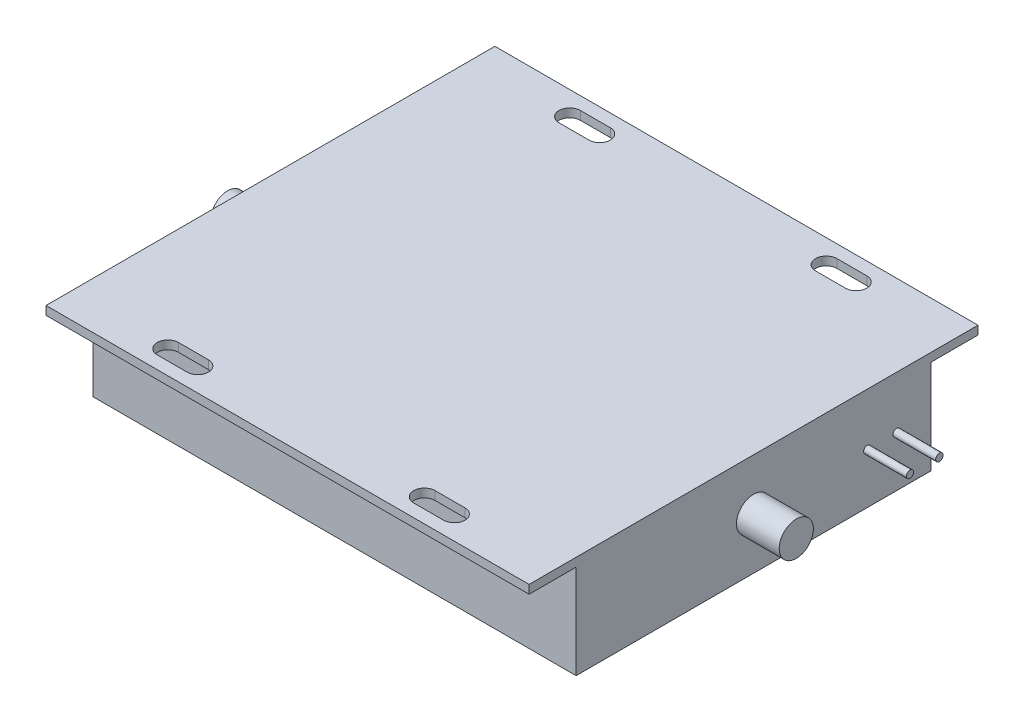
ISO-10303-21;
HEADER;
FILE_DESCRIPTION(('STEP AP214'),'2;1');
FILE_NAME('part.step','',(''),(''),'','','');
FILE_SCHEMA(('AUTOMOTIVE_DESIGN { 1 0 10303 214 1 1 1 1 }'));
ENDSEC;
DATA;
#1=APPLICATION_CONTEXT('core data for automotive mechanical design processes');
#2=APPLICATION_PROTOCOL_DEFINITION('international standard','automotive_design',2000,#1);
#3=PRODUCT_CONTEXT('',#1,'mechanical');
#4=PRODUCT('Part','Part','',(#3));
#5=PRODUCT_RELATED_PRODUCT_CATEGORY('part','',(#4));
#6=PRODUCT_DEFINITION_FORMATION('','',#4);
#7=PRODUCT_DEFINITION_CONTEXT('part definition',#1,'design');
#8=PRODUCT_DEFINITION('design','',#6,#7);
#9=PRODUCT_DEFINITION_SHAPE('','',#8);
#10=(LENGTH_UNIT() NAMED_UNIT(*) SI_UNIT(.MILLI.,.METRE.));
#11=(NAMED_UNIT(*) PLANE_ANGLE_UNIT() SI_UNIT($,.RADIAN.));
#12=(NAMED_UNIT(*) SI_UNIT($,.STERADIAN.) SOLID_ANGLE_UNIT());
#13=UNCERTAINTY_MEASURE_WITH_UNIT(LENGTH_MEASURE(1.E-05),#10,'distance_accuracy_value','');
#14=(GEOMETRIC_REPRESENTATION_CONTEXT(3) GLOBAL_UNCERTAINTY_ASSIGNED_CONTEXT((#13)) GLOBAL_UNIT_ASSIGNED_CONTEXT((#10,
#11,#12)) REPRESENTATION_CONTEXT('',''));
#15=CARTESIAN_POINT('',(0.,0.,0.));
#16=DIRECTION('',(0.,0.,1.));
#17=DIRECTION('',(1.,0.,0.));
#18=AXIS2_PLACEMENT_3D('',#15,#16,#17);
#19=CARTESIAN_POINT('',(0.,31.,0.));
#20=DIRECTION('',(0.,1.,0.));
#21=DIRECTION('',(0.,0.,1.));
#22=AXIS2_PLACEMENT_3D('',#19,#20,#21);
#23=PLANE('',#22);
#24=CARTESIAN_POINT('',(-26.5,31.,47.));
#25=DIRECTION('',(0.,1.,0.));
#26=DIRECTION('',(0.,0.,-1.));
#27=AXIS2_PLACEMENT_3D('',#24,#25,#26);
#28=CIRCLE('',#27,2.50000000000001);
#29=CARTESIAN_POINT('',(-26.5,31.,49.5));
#30=VERTEX_POINT('',#29);
#31=CARTESIAN_POINT('',(-26.5,31.,44.5));
#32=VERTEX_POINT('',#31);
#33=EDGE_CURVE('E218',#30,#32,#28,.T.);
#34=ORIENTED_EDGE('',*,*,#33,.F.);
#35=DIRECTION('',(-1.,0.,0.));
#36=VECTOR('',#35,1.);
#37=CARTESIAN_POINT('',(-26.5,31.,49.5));
#38=LINE('',#37,#36);
#39=CARTESIAN_POINT('',(-33.5,31.,49.5));
#40=VERTEX_POINT('',#39);
#41=EDGE_CURVE('E228',#30,#40,#38,.T.);
#42=ORIENTED_EDGE('',*,*,#41,.T.);
#43=CARTESIAN_POINT('',(-33.5,31.,47.));
#44=DIRECTION('',(0.,1.,0.));
#45=DIRECTION('',(0.,0.,-1.));
#46=AXIS2_PLACEMENT_3D('',#43,#44,#45);
#47=CIRCLE('',#46,2.5);
#48=CARTESIAN_POINT('',(-33.5,31.,44.5));
#49=VERTEX_POINT('',#48);
#50=EDGE_CURVE('E225',#49,#40,#47,.T.);
#51=ORIENTED_EDGE('',*,*,#50,.F.);
#52=DIRECTION('',(-1.,0.,0.));
#53=VECTOR('',#52,1.);
#54=CARTESIAN_POINT('',(-26.5,31.,44.5));
#55=LINE('',#54,#53);
#56=EDGE_CURVE('E222',#32,#49,#55,.T.);
#57=ORIENTED_EDGE('',*,*,#56,.F.);
#58=EDGE_LOOP('',(#34,#42,#51,#57));
#59=FACE_BOUND('',#58,.T.);
#60=CARTESIAN_POINT('',(26.5,31.,-47.));
#61=DIRECTION('',(0.,1.,0.));
#62=DIRECTION('',(0.,0.,1.));
#63=AXIS2_PLACEMENT_3D('',#60,#61,#62);
#64=CIRCLE('',#63,2.50000000000001);
#65=CARTESIAN_POINT('',(26.5,31.,-49.5));
#66=VERTEX_POINT('',#65);
#67=CARTESIAN_POINT('',(26.5,31.,-44.5));
#68=VERTEX_POINT('',#67);
#69=EDGE_CURVE('E255',#66,#68,#64,.T.);
#70=ORIENTED_EDGE('',*,*,#69,.F.);
#71=DIRECTION('',(1.,0.,0.));
#72=VECTOR('',#71,1.);
#73=CARTESIAN_POINT('',(26.5,31.,-49.5));
#74=LINE('',#73,#72);
#75=CARTESIAN_POINT('',(33.5,31.,-49.5));
#76=VERTEX_POINT('',#75);
#77=EDGE_CURVE('E269',#66,#76,#74,.T.);
#78=ORIENTED_EDGE('',*,*,#77,.T.);
#79=CARTESIAN_POINT('',(33.5,31.,-47.));
#80=DIRECTION('',(0.,1.,0.));
#81=DIRECTION('',(0.,0.,1.));
#82=AXIS2_PLACEMENT_3D('',#79,#80,#81);
#83=CIRCLE('',#82,2.5);
#84=CARTESIAN_POINT('',(33.5,31.,-44.5));
#85=VERTEX_POINT('',#84);
#86=EDGE_CURVE('E266',#85,#76,#83,.T.);
#87=ORIENTED_EDGE('',*,*,#86,.F.);
#88=DIRECTION('',(1.,0.,0.));
#89=VECTOR('',#88,1.);
#90=CARTESIAN_POINT('',(26.5,31.,-44.5));
#91=LINE('',#90,#89);
#92=EDGE_CURVE('E263',#68,#85,#91,.T.);
#93=ORIENTED_EDGE('',*,*,#92,.F.);
#94=EDGE_LOOP('',(#70,#78,#87,#93));
#95=FACE_BOUND('',#94,.T.);
#96=DIRECTION('',(0.,0.,1.));
#97=VECTOR('',#96,1.);
#98=CARTESIAN_POINT('',(-56.5,31.,-41.5));
#99=LINE('',#98,#97);
#100=CARTESIAN_POINT('',(-56.5,31.,-52.5));
#101=VERTEX_POINT('',#100);
#102=CARTESIAN_POINT('',(-56.5,31.,52.5));
#103=VERTEX_POINT('',#102);
#104=EDGE_CURVE('E322',#101,#103,#99,.T.);
#105=ORIENTED_EDGE('',*,*,#104,.T.);
#106=DIRECTION('',(1.,0.,0.));
#107=VECTOR('',#106,1.);
#108=CARTESIAN_POINT('',(56.5,31.,52.5));
#109=LINE('',#108,#107);
#110=CARTESIAN_POINT('',(56.5,31.,52.5));
#111=VERTEX_POINT('',#110);
#112=EDGE_CURVE('E286',#103,#111,#109,.T.);
#113=ORIENTED_EDGE('',*,*,#112,.T.);
#114=DIRECTION('',(0.,0.,-1.));
#115=VECTOR('',#114,1.);
#116=CARTESIAN_POINT('',(56.5,31.,41.5));
#117=LINE('',#116,#115);
#118=CARTESIAN_POINT('',(56.5,31.,-52.5));
#119=VERTEX_POINT('',#118);
#120=EDGE_CURVE('E317',#111,#119,#117,.T.);
#121=ORIENTED_EDGE('',*,*,#120,.T.);
#122=DIRECTION('',(1.,0.,0.));
#123=VECTOR('',#122,1.);
#124=CARTESIAN_POINT('',(56.5,31.,-52.5));
#125=LINE('',#124,#123);
#126=EDGE_CURVE('E291',#101,#119,#125,.T.);
#127=ORIENTED_EDGE('',*,*,#126,.F.);
#128=EDGE_LOOP('',(#105,#113,#121,#127));
#129=FACE_BOUND('',#128,.T.);
#130=DIRECTION('',(-1.,0.,0.));
#131=VECTOR('',#130,1.);
#132=CARTESIAN_POINT('',(-26.5,31.,-49.5));
#133=LINE('',#132,#131);
#134=CARTESIAN_POINT('',(-26.5,31.,-49.5));
#135=VERTEX_POINT('',#134);
#136=CARTESIAN_POINT('',(-33.5,31.,-49.5));
#137=VERTEX_POINT('',#136);
#138=EDGE_CURVE('E243',#135,#137,#133,.T.);
#139=ORIENTED_EDGE('',*,*,#138,.F.);
#140=CARTESIAN_POINT('',(-26.5,31.,-47.));
#141=DIRECTION('',(0.,-1.,0.));
#142=DIRECTION('',(0.,0.,1.));
#143=AXIS2_PLACEMENT_3D('',#140,#141,#142);
#144=CIRCLE('',#143,2.50000000000001);
#145=CARTESIAN_POINT('',(-26.5,31.,-44.5));
#146=VERTEX_POINT('',#145);
#147=EDGE_CURVE('E234',#135,#146,#144,.T.);
#148=ORIENTED_EDGE('',*,*,#147,.T.);
#149=DIRECTION('',(-1.,0.,0.));
#150=VECTOR('',#149,1.);
#151=CARTESIAN_POINT('',(-26.5,31.,-44.5));
#152=LINE('',#151,#150);
#153=CARTESIAN_POINT('',(-33.5,31.,-44.5));
#154=VERTEX_POINT('',#153);
#155=EDGE_CURVE('E249',#146,#154,#152,.T.);
#156=ORIENTED_EDGE('',*,*,#155,.T.);
#157=CARTESIAN_POINT('',(-33.5,31.,-47.));
#158=DIRECTION('',(0.,-1.,0.));
#159=DIRECTION('',(0.,0.,1.));
#160=AXIS2_PLACEMENT_3D('',#157,#158,#159);
#161=CIRCLE('',#160,2.5);
#162=EDGE_CURVE('E246',#154,#137,#161,.T.);
#163=ORIENTED_EDGE('',*,*,#162,.T.);
#164=EDGE_LOOP('',(#139,#148,#156,#163));
#165=FACE_BOUND('',#164,.T.);
#166=DIRECTION('',(1.,0.,0.));
#167=VECTOR('',#166,1.);
#168=CARTESIAN_POINT('',(26.5,31.,49.5));
#169=LINE('',#168,#167);
#170=CARTESIAN_POINT('',(26.5,31.,49.5));
#171=VERTEX_POINT('',#170);
#172=CARTESIAN_POINT('',(33.5,31.,49.5));
#173=VERTEX_POINT('',#172);
#174=EDGE_CURVE('E206',#171,#173,#169,.T.);
#175=ORIENTED_EDGE('',*,*,#174,.F.);
#176=CARTESIAN_POINT('',(26.5,31.,47.));
#177=DIRECTION('',(0.,-1.,0.));
#178=DIRECTION('',(0.,0.,-1.));
#179=AXIS2_PLACEMENT_3D('',#176,#177,#178);
#180=CIRCLE('',#179,2.50000000000001);
#181=CARTESIAN_POINT('',(26.5,31.,44.5));
#182=VERTEX_POINT('',#181);
#183=EDGE_CURVE('E48',#171,#182,#180,.T.);
#184=ORIENTED_EDGE('',*,*,#183,.T.);
#185=DIRECTION('',(1.,0.,0.));
#186=VECTOR('',#185,1.);
#187=CARTESIAN_POINT('',(26.5,31.,44.5));
#188=LINE('',#187,#186);
#189=CARTESIAN_POINT('',(33.5,31.,44.5));
#190=VERTEX_POINT('',#189);
#191=EDGE_CURVE('E211',#182,#190,#188,.T.);
#192=ORIENTED_EDGE('',*,*,#191,.T.);
#193=CARTESIAN_POINT('',(33.5,31.,47.));
#194=DIRECTION('',(0.,-1.,0.));
#195=DIRECTION('',(0.,0.,-1.));
#196=AXIS2_PLACEMENT_3D('',#193,#194,#195);
#197=CIRCLE('',#196,2.5);
#198=EDGE_CURVE('E197',#190,#173,#197,.T.);
#199=ORIENTED_EDGE('',*,*,#198,.T.);
#200=EDGE_LOOP('',(#175,#184,#192,#199));
#201=FACE_BOUND('',#200,.T.);
#202=ADVANCED_FACE('F33',(#59,#95,#129,#165,#201),#23,.T.);
#203=CARTESIAN_POINT('',(-56.5,29.,-52.5));
#204=DIRECTION('',(0.,1.,0.));
#205=DIRECTION('',(-1.,0.,0.));
#206=AXIS2_PLACEMENT_3D('',#203,#204,#205);
#207=PLANE('',#206);
#208=DIRECTION('',(-1.,0.,0.));
#209=VECTOR('',#208,1.);
#210=CARTESIAN_POINT('',(-56.5,29.,41.5));
#211=LINE('',#210,#209);
#212=CARTESIAN_POINT('',(56.5,29.,41.5));
#213=VERTEX_POINT('',#212);
#214=CARTESIAN_POINT('',(-56.5,29.,41.5));
#215=VERTEX_POINT('',#214);
#216=EDGE_CURVE('E314',#213,#215,#211,.T.);
#217=ORIENTED_EDGE('',*,*,#216,.F.);
#218=DIRECTION('',(0.,0.,1.));
#219=VECTOR('',#218,1.);
#220=CARTESIAN_POINT('',(56.5,29.,-52.5));
#221=LINE('',#220,#219);
#222=CARTESIAN_POINT('',(56.5,29.,52.5));
#223=VERTEX_POINT('',#222);
#224=EDGE_CURVE('E308',#213,#223,#221,.T.);
#225=ORIENTED_EDGE('',*,*,#224,.T.);
#226=DIRECTION('',(-1.,0.,0.));
#227=VECTOR('',#226,1.);
#228=CARTESIAN_POINT('',(-56.5,29.,52.5));
#229=LINE('',#228,#227);
#230=CARTESIAN_POINT('',(-56.5,29.,52.5));
#231=VERTEX_POINT('',#230);
#232=EDGE_CURVE('E297',#223,#231,#229,.T.);
#233=ORIENTED_EDGE('',*,*,#232,.T.);
#234=DIRECTION('',(0.,0.,1.));
#235=VECTOR('',#234,1.);
#236=CARTESIAN_POINT('',(-56.5,29.,-52.5));
#237=LINE('',#236,#235);
#238=EDGE_CURVE('E294',#215,#231,#237,.T.);
#239=ORIENTED_EDGE('',*,*,#238,.F.);
#240=EDGE_LOOP('',(#217,#225,#233,#239));
#241=FACE_BOUND('',#240,.T.);
#242=DIRECTION('',(-1.,0.,0.));
#243=VECTOR('',#242,1.);
#244=CARTESIAN_POINT('',(-56.5000000000001,29.,49.5));
#245=LINE('',#244,#243);
#246=CARTESIAN_POINT('',(-26.5,29.,49.5));
#247=VERTEX_POINT('',#246);
#248=CARTESIAN_POINT('',(-33.5,29.,49.5));
#249=VERTEX_POINT('',#248);
#250=EDGE_CURVE('E372',#247,#249,#245,.T.);
#251=ORIENTED_EDGE('',*,*,#250,.F.);
#252=CARTESIAN_POINT('',(-26.5,29.,47.));
#253=DIRECTION('',(0.,1.,0.));
#254=DIRECTION('',(-1.,0.,0.));
#255=AXIS2_PLACEMENT_3D('',#252,#253,#254);
#256=CIRCLE('',#255,2.50000000000001);
#257=CARTESIAN_POINT('',(-26.5,29.,44.5));
#258=VERTEX_POINT('',#257);
#259=EDGE_CURVE('E374',#247,#258,#256,.T.);
#260=ORIENTED_EDGE('',*,*,#259,.T.);
#261=DIRECTION('',(-1.,0.,0.));
#262=VECTOR('',#261,1.);
#263=CARTESIAN_POINT('',(-56.4999999999999,29.,44.5));
#264=LINE('',#263,#262);
#265=CARTESIAN_POINT('',(-33.5,29.,44.5));
#266=VERTEX_POINT('',#265);
#267=EDGE_CURVE('E366',#258,#266,#264,.T.);
#268=ORIENTED_EDGE('',*,*,#267,.T.);
#269=CARTESIAN_POINT('',(-33.5,29.,47.));
#270=DIRECTION('',(0.,1.,0.));
#271=DIRECTION('',(-1.,0.,0.));
#272=AXIS2_PLACEMENT_3D('',#269,#270,#271);
#273=CIRCLE('',#272,2.5);
#274=EDGE_CURVE('E369',#266,#249,#273,.T.);
#275=ORIENTED_EDGE('',*,*,#274,.T.);
#276=EDGE_LOOP('',(#251,#260,#268,#275));
#277=FACE_BOUND('',#276,.T.);
#278=CARTESIAN_POINT('',(26.5,29.,47.));
#279=DIRECTION('',(0.,1.,0.));
#280=DIRECTION('',(-1.,0.,0.));
#281=AXIS2_PLACEMENT_3D('',#278,#279,#280);
#282=CIRCLE('',#281,2.50000000000001);
#283=CARTESIAN_POINT('',(26.5,29.,49.5));
#284=VERTEX_POINT('',#283);
#285=CARTESIAN_POINT('',(26.5,29.,44.5));
#286=VERTEX_POINT('',#285);
#287=EDGE_CURVE('E41',#284,#286,#282,.F.);
#288=ORIENTED_EDGE('',*,*,#287,.F.);
#289=DIRECTION('',(1.,0.,0.));
#290=VECTOR('',#289,1.);
#291=CARTESIAN_POINT('',(-56.4999999999999,29.,49.5000000000001));
#292=LINE('',#291,#290);
#293=CARTESIAN_POINT('',(33.5,29.,49.5));
#294=VERTEX_POINT('',#293);
#295=EDGE_CURVE('E377',#284,#294,#292,.T.);
#296=ORIENTED_EDGE('',*,*,#295,.T.);
#297=CARTESIAN_POINT('',(33.5,29.,47.));
#298=DIRECTION('',(0.,1.,0.));
#299=DIRECTION('',(-1.,0.,0.));
#300=AXIS2_PLACEMENT_3D('',#297,#298,#299);
#301=CIRCLE('',#300,2.5);
#302=CARTESIAN_POINT('',(33.5,29.,44.5));
#303=VERTEX_POINT('',#302);
#304=EDGE_CURVE('E200',#303,#294,#301,.F.);
#305=ORIENTED_EDGE('',*,*,#304,.F.);
#306=DIRECTION('',(1.,0.,0.));
#307=VECTOR('',#306,1.);
#308=CARTESIAN_POINT('',(-56.5000000000001,29.,44.4999999999999));
#309=LINE('',#308,#307);
#310=EDGE_CURVE('E380',#286,#303,#309,.T.);
#311=ORIENTED_EDGE('',*,*,#310,.F.);
#312=EDGE_LOOP('',(#288,#296,#305,#311));
#313=FACE_BOUND('',#312,.T.);
#314=ADVANCED_FACE('F388',(#241,#277,#313),#207,.F.);
#315=DIRECTION('',(1.,0.,0.));
#316=VECTOR('',#315,1.);
#317=CARTESIAN_POINT('',(56.5,29.,-41.5));
#318=LINE('',#317,#316);
#319=CARTESIAN_POINT('',(-56.5,29.,-41.5));
#320=VERTEX_POINT('',#319);
#321=CARTESIAN_POINT('',(56.5,29.,-41.5));
#322=VERTEX_POINT('',#321);
#323=EDGE_CURVE('E311',#320,#322,#318,.T.);
#324=ORIENTED_EDGE('',*,*,#323,.F.);
#325=CARTESIAN_POINT('',(-56.5,29.,-52.5));
#326=VERTEX_POINT('',#325);
#327=EDGE_CURVE('E305',#326,#320,#237,.T.);
#328=ORIENTED_EDGE('',*,*,#327,.F.);
#329=DIRECTION('',(-1.,0.,0.));
#330=VECTOR('',#329,1.);
#331=CARTESIAN_POINT('',(-56.5,29.,-52.5));
#332=LINE('',#331,#330);
#333=CARTESIAN_POINT('',(56.5,29.,-52.5));
#334=VERTEX_POINT('',#333);
#335=EDGE_CURVE('E285',#334,#326,#332,.T.);
#336=ORIENTED_EDGE('',*,*,#335,.F.);
#337=EDGE_CURVE('E309',#334,#322,#221,.T.);
#338=ORIENTED_EDGE('',*,*,#337,.T.);
#339=EDGE_LOOP('',(#324,#328,#336,#338));
#340=FACE_BOUND('',#339,.T.);
#341=DIRECTION('',(1.,0.,0.));
#342=VECTOR('',#341,1.);
#343=CARTESIAN_POINT('',(-56.5,29.,-49.5000000000001));
#344=LINE('',#343,#342);
#345=CARTESIAN_POINT('',(26.5,29.,-49.5));
#346=VERTEX_POINT('',#345);
#347=CARTESIAN_POINT('',(33.5,29.,-49.5));
#348=VERTEX_POINT('',#347);
#349=EDGE_CURVE('E351',#346,#348,#344,.T.);
#350=ORIENTED_EDGE('',*,*,#349,.F.);
#351=CARTESIAN_POINT('',(26.5,29.,-47.));
#352=DIRECTION('',(0.,1.,0.));
#353=DIRECTION('',(-1.,0.,0.));
#354=AXIS2_PLACEMENT_3D('',#351,#352,#353);
#355=CIRCLE('',#354,2.50000000000001);
#356=CARTESIAN_POINT('',(26.5,29.,-44.5));
#357=VERTEX_POINT('',#356);
#358=EDGE_CURVE('E353',#346,#357,#355,.T.);
#359=ORIENTED_EDGE('',*,*,#358,.T.);
#360=DIRECTION('',(1.,0.,0.));
#361=VECTOR('',#360,1.);
#362=CARTESIAN_POINT('',(-56.5,29.,-44.4999999999999));
#363=LINE('',#362,#361);
#364=CARTESIAN_POINT('',(33.5,29.,-44.5));
#365=VERTEX_POINT('',#364);
#366=EDGE_CURVE('E337',#357,#365,#363,.T.);
#367=ORIENTED_EDGE('',*,*,#366,.T.);
#368=CARTESIAN_POINT('',(33.5,29.,-47.));
#369=DIRECTION('',(0.,1.,0.));
#370=DIRECTION('',(-1.,0.,0.));
#371=AXIS2_PLACEMENT_3D('',#368,#369,#370);
#372=CIRCLE('',#371,2.5);
#373=EDGE_CURVE('E348',#365,#348,#372,.T.);
#374=ORIENTED_EDGE('',*,*,#373,.T.);
#375=EDGE_LOOP('',(#350,#359,#367,#374));
#376=FACE_BOUND('',#375,.T.);
#377=CARTESIAN_POINT('',(-26.5,29.,-47.));
#378=DIRECTION('',(0.,1.,0.));
#379=DIRECTION('',(-1.,0.,0.));
#380=AXIS2_PLACEMENT_3D('',#377,#378,#379);
#381=CIRCLE('',#380,2.50000000000001);
#382=CARTESIAN_POINT('',(-26.5,29.,-49.5));
#383=VERTEX_POINT('',#382);
#384=CARTESIAN_POINT('',(-26.5,29.,-44.5));
#385=VERTEX_POINT('',#384);
#386=EDGE_CURVE('E364',#383,#385,#381,.F.);
#387=ORIENTED_EDGE('',*,*,#386,.F.);
#388=DIRECTION('',(-1.,0.,0.));
#389=VECTOR('',#388,1.);
#390=CARTESIAN_POINT('',(-56.5,29.,-49.5));
#391=LINE('',#390,#389);
#392=CARTESIAN_POINT('',(-33.5,29.,-49.5));
#393=VERTEX_POINT('',#392);
#394=EDGE_CURVE('E356',#383,#393,#391,.T.);
#395=ORIENTED_EDGE('',*,*,#394,.T.);
#396=CARTESIAN_POINT('',(-33.5,29.,-47.));
#397=DIRECTION('',(0.,1.,0.));
#398=DIRECTION('',(-1.,0.,0.));
#399=AXIS2_PLACEMENT_3D('',#396,#397,#398);
#400=CIRCLE('',#399,2.5);
#401=CARTESIAN_POINT('',(-33.5,29.,-44.5));
#402=VERTEX_POINT('',#401);
#403=EDGE_CURVE('E359',#402,#393,#400,.F.);
#404=ORIENTED_EDGE('',*,*,#403,.F.);
#405=DIRECTION('',(-1.,0.,0.));
#406=VECTOR('',#405,1.);
#407=CARTESIAN_POINT('',(-56.5,29.,-44.5));
#408=LINE('',#407,#406);
#409=EDGE_CURVE('E362',#385,#402,#408,.T.);
#410=ORIENTED_EDGE('',*,*,#409,.F.);
#411=EDGE_LOOP('',(#387,#395,#404,#410));
#412=FACE_BOUND('',#411,.T.);
#413=ADVANCED_FACE('F390',(#340,#376,#412),#207,.F.);
#414=CARTESIAN_POINT('',(-56.5,7.,41.5));
#415=DIRECTION('',(0.,0.,1.));
#416=DIRECTION('',(1.,0.,0.));
#417=AXIS2_PLACEMENT_3D('',#414,#415,#416);
#418=PLANE('',#417);
#419=DIRECTION('',(0.,1.,0.));
#420=VECTOR('',#419,1.);
#421=CARTESIAN_POINT('',(56.5,7.,41.5));
#422=LINE('',#421,#420);
#423=CARTESIAN_POINT('',(56.5,7.,41.5));
#424=VERTEX_POINT('',#423);
#425=EDGE_CURVE('E331',#424,#213,#422,.T.);
#426=ORIENTED_EDGE('',*,*,#425,.T.);
#427=ORIENTED_EDGE('',*,*,#216,.T.);
#428=DIRECTION('',(0.,1.,0.));
#429=VECTOR('',#428,1.);
#430=CARTESIAN_POINT('',(-56.5,7.,41.5));
#431=LINE('',#430,#429);
#432=CARTESIAN_POINT('',(-56.5,7.,41.5));
#433=VERTEX_POINT('',#432);
#434=EDGE_CURVE('E334',#433,#215,#431,.T.);
#435=ORIENTED_EDGE('',*,*,#434,.F.);
#436=DIRECTION('',(1.,0.,0.));
#437=VECTOR('',#436,1.);
#438=CARTESIAN_POINT('',(-56.5,7.,41.5));
#439=LINE('',#438,#437);
#440=EDGE_CURVE('E318',#433,#424,#439,.T.);
#441=ORIENTED_EDGE('',*,*,#440,.T.);
#442=EDGE_LOOP('',(#426,#427,#435,#441));
#443=FACE_BOUND('',#442,.T.);
#444=ADVANCED_FACE('F35',(#443),#418,.T.);
#445=CARTESIAN_POINT('',(56.5,7.,-41.5));
#446=DIRECTION('',(0.,0.,-1.));
#447=DIRECTION('',(-1.,0.,0.));
#448=AXIS2_PLACEMENT_3D('',#445,#446,#447);
#449=PLANE('',#448);
#450=DIRECTION('',(0.,1.,0.));
#451=VECTOR('',#450,1.);
#452=CARTESIAN_POINT('',(-56.5,7.,-41.5));
#453=LINE('',#452,#451);
#454=CARTESIAN_POINT('',(-56.5,7.,-41.5));
#455=VERTEX_POINT('',#454);
#456=EDGE_CURVE('E338',#455,#320,#453,.T.);
#457=ORIENTED_EDGE('',*,*,#456,.T.);
#458=ORIENTED_EDGE('',*,*,#323,.T.);
#459=DIRECTION('',(0.,1.,0.));
#460=VECTOR('',#459,1.);
#461=CARTESIAN_POINT('',(56.5,7.,-41.5));
#462=LINE('',#461,#460);
#463=CARTESIAN_POINT('',(56.5,7.,-41.5));
#464=VERTEX_POINT('',#463);
#465=EDGE_CURVE('E341',#464,#322,#462,.T.);
#466=ORIENTED_EDGE('',*,*,#465,.F.);
#467=DIRECTION('',(-1.,0.,0.));
#468=VECTOR('',#467,1.);
#469=CARTESIAN_POINT('',(56.5,7.,-41.5));
#470=LINE('',#469,#468);
#471=EDGE_CURVE('E325',#464,#455,#470,.T.);
#472=ORIENTED_EDGE('',*,*,#471,.T.);
#473=EDGE_LOOP('',(#457,#458,#466,#472));
#474=FACE_BOUND('',#473,.T.);
#475=ADVANCED_FACE('F414',(#474),#449,.T.);
#476=CARTESIAN_POINT('',(-56.5,7.,-41.5));
#477=DIRECTION('',(-1.,0.,0.));
#478=DIRECTION('',(0.,0.,1.));
#479=AXIS2_PLACEMENT_3D('',#476,#477,#478);
#480=PLANE('',#479);
#481=CARTESIAN_POINT('',(-56.5,19.,0.));
#482=DIRECTION('',(-1.,0.,0.));
#483=DIRECTION('',(0.,0.,1.));
#484=AXIS2_PLACEMENT_3D('',#481,#482,#483);
#485=CIRCLE('',#484,4.);
#486=CARTESIAN_POINT('',(-56.5,19.,4.));
#487=VERTEX_POINT('',#486);
#488=EDGE_CURVE('E560',#487,#487,#485,.T.);
#489=ORIENTED_EDGE('',*,*,#488,.F.);
#490=EDGE_LOOP('',(#489));
#491=FACE_BOUND('',#490,.T.);
#492=ORIENTED_EDGE('',*,*,#327,.T.);
#493=ORIENTED_EDGE('',*,*,#456,.F.);
#494=DIRECTION('',(0.,0.,1.));
#495=VECTOR('',#494,1.);
#496=CARTESIAN_POINT('',(-56.5,7.,-41.5));
#497=LINE('',#496,#495);
#498=EDGE_CURVE('E328',#455,#433,#497,.T.);
#499=ORIENTED_EDGE('',*,*,#498,.T.);
#500=ORIENTED_EDGE('',*,*,#434,.T.);
#501=ORIENTED_EDGE('',*,*,#238,.T.);
#502=DIRECTION('',(0.,1.,0.));
#503=VECTOR('',#502,1.);
#504=CARTESIAN_POINT('',(-56.5,31.,52.5));
#505=LINE('',#504,#503);
#506=EDGE_CURVE('E300',#231,#103,#505,.T.);
#507=ORIENTED_EDGE('',*,*,#506,.T.);
#508=ORIENTED_EDGE('',*,*,#104,.F.);
#509=DIRECTION('',(0.,1.,0.));
#510=VECTOR('',#509,1.);
#511=CARTESIAN_POINT('',(-56.5,31.,-52.5));
#512=LINE('',#511,#510);
#513=EDGE_CURVE('E288',#326,#101,#512,.T.);
#514=ORIENTED_EDGE('',*,*,#513,.F.);
#515=EDGE_LOOP('',(#492,#493,#499,#500,#501,#507,#508,#514));
#516=FACE_BOUND('',#515,.T.);
#517=ADVANCED_FACE('F411',(#491,#516),#480,.T.);
#518=CARTESIAN_POINT('',(56.5,7.,41.5));
#519=DIRECTION('',(1.,0.,0.));
#520=DIRECTION('',(0.,0.,-1.));
#521=AXIS2_PLACEMENT_3D('',#518,#519,#520);
#522=PLANE('',#521);
#523=CARTESIAN_POINT('',(56.5,18.7692204825578,-33.4661006248419));
#524=DIRECTION('',(1.,0.,0.));
#525=DIRECTION('',(0.,0.,-1.));
#526=AXIS2_PLACEMENT_3D('',#523,#524,#525);
#527=CIRCLE('',#526,0.866649433394376);
#528=CARTESIAN_POINT('',(56.5,18.7692204825578,-34.3327500582363));
#529=VERTEX_POINT('',#528);
#530=EDGE_CURVE('E425',#529,#529,#527,.T.);
#531=ORIENTED_EDGE('',*,*,#530,.F.);
#532=EDGE_LOOP('',(#531));
#533=FACE_BOUND('',#532,.T.);
#534=CARTESIAN_POINT('',(56.5,18.7692204825578,-26.5865595970371));
#535=DIRECTION('',(1.,0.,0.));
#536=DIRECTION('',(0.,0.,-1.));
#537=AXIS2_PLACEMENT_3D('',#534,#535,#536);
#538=CIRCLE('',#537,0.835314328900505);
#539=CARTESIAN_POINT('',(56.5,18.7692204825578,-27.4218739259376));
#540=VERTEX_POINT('',#539);
#541=EDGE_CURVE('E429',#540,#540,#538,.T.);
#542=ORIENTED_EDGE('',*,*,#541,.F.);
#543=EDGE_LOOP('',(#542));
#544=FACE_BOUND('',#543,.T.);
#545=CARTESIAN_POINT('',(56.5,19.,0.));
#546=DIRECTION('',(1.,0.,0.));
#547=DIRECTION('',(0.,0.,-1.));
#548=AXIS2_PLACEMENT_3D('',#545,#546,#547);
#549=CIRCLE('',#548,4.);
#550=CARTESIAN_POINT('',(56.5,19.,-4.));
#551=VERTEX_POINT('',#550);
#552=EDGE_CURVE('E11',#551,#551,#549,.T.);
#553=ORIENTED_EDGE('',*,*,#552,.F.);
#554=EDGE_LOOP('',(#553));
#555=FACE_BOUND('',#554,.T.);
#556=ORIENTED_EDGE('',*,*,#120,.F.);
#557=DIRECTION('',(0.,-1.,0.));
#558=VECTOR('',#557,1.);
#559=CARTESIAN_POINT('',(56.5,29.,52.5));
#560=LINE('',#559,#558);
#561=EDGE_CURVE('E275',#111,#223,#560,.T.);
#562=ORIENTED_EDGE('',*,*,#561,.T.);
#563=ORIENTED_EDGE('',*,*,#224,.F.);
#564=ORIENTED_EDGE('',*,*,#425,.F.);
#565=DIRECTION('',(0.,0.,-1.));
#566=VECTOR('',#565,1.);
#567=CARTESIAN_POINT('',(56.5,7.,41.5));
#568=LINE('',#567,#566);
#569=EDGE_CURVE('E321',#424,#464,#568,.T.);
#570=ORIENTED_EDGE('',*,*,#569,.T.);
#571=ORIENTED_EDGE('',*,*,#465,.T.);
#572=ORIENTED_EDGE('',*,*,#337,.F.);
#573=DIRECTION('',(0.,-1.,0.));
#574=VECTOR('',#573,1.);
#575=CARTESIAN_POINT('',(56.5,29.,-52.5));
#576=LINE('',#575,#574);
#577=EDGE_CURVE('E282',#119,#334,#576,.T.);
#578=ORIENTED_EDGE('',*,*,#577,.F.);
#579=EDGE_LOOP('',(#556,#562,#563,#564,#570,#571,#572,#578));
#580=FACE_BOUND('',#579,.T.);
#581=ADVANCED_FACE('F408',(#533,#544,#555,#580),#522,.T.);
#582=CARTESIAN_POINT('',(0.,7.,0.));
#583=DIRECTION('',(0.,1.,0.));
#584=DIRECTION('',(0.,0.,1.));
#585=AXIS2_PLACEMENT_3D('',#582,#583,#584);
#586=PLANE('',#585);
#587=ORIENTED_EDGE('',*,*,#440,.F.);
#588=ORIENTED_EDGE('',*,*,#498,.F.);
#589=ORIENTED_EDGE('',*,*,#471,.F.);
#590=ORIENTED_EDGE('',*,*,#569,.F.);
#591=EDGE_LOOP('',(#587,#588,#589,#590));
#592=FACE_BOUND('',#591,.T.);
#593=ADVANCED_FACE('F405',(#592),#586,.F.);
#594=CARTESIAN_POINT('',(0.,0.,-52.5));
#595=DIRECTION('',(0.,0.,1.));
#596=DIRECTION('',(1.,0.,0.));
#597=AXIS2_PLACEMENT_3D('',#594,#595,#596);
#598=PLANE('',#597);
#599=ORIENTED_EDGE('',*,*,#577,.T.);
#600=ORIENTED_EDGE('',*,*,#335,.T.);
#601=ORIENTED_EDGE('',*,*,#513,.T.);
#602=ORIENTED_EDGE('',*,*,#126,.T.);
#603=EDGE_LOOP('',(#599,#600,#601,#602));
#604=FACE_BOUND('',#603,.T.);
#605=ADVANCED_FACE('F407',(#604),#598,.F.);
#606=CARTESIAN_POINT('',(0.,0.,52.5));
#607=DIRECTION('',(0.,0.,1.));
#608=DIRECTION('',(1.,0.,0.));
#609=AXIS2_PLACEMENT_3D('',#606,#607,#608);
#610=PLANE('',#609);
#611=ORIENTED_EDGE('',*,*,#561,.F.);
#612=ORIENTED_EDGE('',*,*,#112,.F.);
#613=ORIENTED_EDGE('',*,*,#506,.F.);
#614=ORIENTED_EDGE('',*,*,#232,.F.);
#615=EDGE_LOOP('',(#611,#612,#613,#614));
#616=FACE_BOUND('',#615,.T.);
#617=ADVANCED_FACE('F403',(#616),#610,.T.);
#618=CARTESIAN_POINT('',(26.5,7.,-47.));
#619=DIRECTION('',(0.,1.,0.));
#620=DIRECTION('',(0.,0.,1.));
#621=AXIS2_PLACEMENT_3D('',#618,#619,#620);
#622=CYLINDRICAL_SURFACE('',#621,2.50000000000001);
#623=DIRECTION('',(0.,1.,0.));
#624=VECTOR('',#623,1.);
#625=CARTESIAN_POINT('',(26.5,7.,-49.5));
#626=LINE('',#625,#624);
#627=EDGE_CURVE('E273',#346,#66,#626,.T.);
#628=ORIENTED_EDGE('',*,*,#627,.T.);
#629=ORIENTED_EDGE('',*,*,#69,.T.);
#630=DIRECTION('',(0.,1.,0.));
#631=VECTOR('',#630,1.);
#632=CARTESIAN_POINT('',(26.5,7.,-44.5));
#633=LINE('',#632,#631);
#634=EDGE_CURVE('E272',#357,#68,#633,.T.);
#635=ORIENTED_EDGE('',*,*,#634,.F.);
#636=ORIENTED_EDGE('',*,*,#358,.F.);
#637=EDGE_LOOP('',(#628,#629,#635,#636));
#638=FACE_BOUND('',#637,.T.);
#639=ADVANCED_FACE('F457',(#638),#622,.F.);
#640=CARTESIAN_POINT('',(26.5,7.,-49.5));
#641=DIRECTION('',(0.,0.,1.));
#642=DIRECTION('',(1.,0.,0.));
#643=AXIS2_PLACEMENT_3D('',#640,#641,#642);
#644=PLANE('',#643);
#645=ORIENTED_EDGE('',*,*,#349,.T.);
#646=DIRECTION('',(0.,1.,0.));
#647=VECTOR('',#646,1.);
#648=CARTESIAN_POINT('',(33.5,7.,-49.5));
#649=LINE('',#648,#647);
#650=EDGE_CURVE('E276',#348,#76,#649,.T.);
#651=ORIENTED_EDGE('',*,*,#650,.T.);
#652=ORIENTED_EDGE('',*,*,#77,.F.);
#653=ORIENTED_EDGE('',*,*,#627,.F.);
#654=EDGE_LOOP('',(#645,#651,#652,#653));
#655=FACE_BOUND('',#654,.T.);
#656=ADVANCED_FACE('F461',(#655),#644,.T.);
#657=CARTESIAN_POINT('',(33.5,7.,-47.));
#658=DIRECTION('',(0.,1.,0.));
#659=DIRECTION('',(0.,0.,1.));
#660=AXIS2_PLACEMENT_3D('',#657,#658,#659);
#661=CYLINDRICAL_SURFACE('',#660,2.5);
#662=DIRECTION('',(0.,1.,0.));
#663=VECTOR('',#662,1.);
#664=CARTESIAN_POINT('',(33.5,7.,-44.5));
#665=LINE('',#664,#663);
#666=EDGE_CURVE('E278',#365,#85,#665,.T.);
#667=ORIENTED_EDGE('',*,*,#666,.T.);
#668=ORIENTED_EDGE('',*,*,#86,.T.);
#669=ORIENTED_EDGE('',*,*,#650,.F.);
#670=ORIENTED_EDGE('',*,*,#373,.F.);
#671=EDGE_LOOP('',(#667,#668,#669,#670));
#672=FACE_BOUND('',#671,.T.);
#673=ADVANCED_FACE('F467',(#672),#661,.F.);
#674=CARTESIAN_POINT('',(26.5,7.,-44.5));
#675=DIRECTION('',(0.,0.,1.));
#676=DIRECTION('',(1.,0.,0.));
#677=AXIS2_PLACEMENT_3D('',#674,#675,#676);
#678=PLANE('',#677);
#679=ORIENTED_EDGE('',*,*,#634,.T.);
#680=ORIENTED_EDGE('',*,*,#92,.T.);
#681=ORIENTED_EDGE('',*,*,#666,.F.);
#682=ORIENTED_EDGE('',*,*,#366,.F.);
#683=EDGE_LOOP('',(#679,#680,#681,#682));
#684=FACE_BOUND('',#683,.T.);
#685=ADVANCED_FACE('F463',(#684),#678,.F.);
#686=CARTESIAN_POINT('',(-26.5,7.,-47.));
#687=DIRECTION('',(0.,1.,0.));
#688=DIRECTION('',(0.,0.,1.));
#689=AXIS2_PLACEMENT_3D('',#686,#687,#688);
#690=CYLINDRICAL_SURFACE('',#689,2.50000000000001);
#691=ORIENTED_EDGE('',*,*,#386,.T.);
#692=DIRECTION('',(0.,1.,0.));
#693=VECTOR('',#692,1.);
#694=CARTESIAN_POINT('',(-26.5,7.,-44.5));
#695=LINE('',#694,#693);
#696=EDGE_CURVE('E253',#385,#146,#695,.T.);
#697=ORIENTED_EDGE('',*,*,#696,.T.);
#698=ORIENTED_EDGE('',*,*,#147,.F.);
#699=DIRECTION('',(0.,1.,0.));
#700=VECTOR('',#699,1.);
#701=CARTESIAN_POINT('',(-26.5,7.,-49.5));
#702=LINE('',#701,#700);
#703=EDGE_CURVE('E252',#383,#135,#702,.T.);
#704=ORIENTED_EDGE('',*,*,#703,.F.);
#705=EDGE_LOOP('',(#691,#697,#698,#704));
#706=FACE_BOUND('',#705,.T.);
#707=ADVANCED_FACE('F466',(#706),#690,.F.);
#708=CARTESIAN_POINT('',(-26.5,7.,-44.5));
#709=DIRECTION('',(0.,0.,-1.));
#710=DIRECTION('',(-1.,0.,0.));
#711=AXIS2_PLACEMENT_3D('',#708,#709,#710);
#712=PLANE('',#711);
#713=ORIENTED_EDGE('',*,*,#409,.T.);
#714=DIRECTION('',(0.,1.,0.));
#715=VECTOR('',#714,1.);
#716=CARTESIAN_POINT('',(-33.5,7.,-44.5));
#717=LINE('',#716,#715);
#718=EDGE_CURVE('E256',#402,#154,#717,.T.);
#719=ORIENTED_EDGE('',*,*,#718,.T.);
#720=ORIENTED_EDGE('',*,*,#155,.F.);
#721=ORIENTED_EDGE('',*,*,#696,.F.);
#722=EDGE_LOOP('',(#713,#719,#720,#721));
#723=FACE_BOUND('',#722,.T.);
#724=ADVANCED_FACE('F477',(#723),#712,.T.);
#725=CARTESIAN_POINT('',(-33.5,7.,-47.));
#726=DIRECTION('',(0.,1.,0.));
#727=DIRECTION('',(0.,0.,1.));
#728=AXIS2_PLACEMENT_3D('',#725,#726,#727);
#729=CYLINDRICAL_SURFACE('',#728,2.5);
#730=ORIENTED_EDGE('',*,*,#403,.T.);
#731=DIRECTION('',(0.,1.,0.));
#732=VECTOR('',#731,1.);
#733=CARTESIAN_POINT('',(-33.5,7.,-49.5));
#734=LINE('',#733,#732);
#735=EDGE_CURVE('E258',#393,#137,#734,.T.);
#736=ORIENTED_EDGE('',*,*,#735,.T.);
#737=ORIENTED_EDGE('',*,*,#162,.F.);
#738=ORIENTED_EDGE('',*,*,#718,.F.);
#739=EDGE_LOOP('',(#730,#736,#737,#738));
#740=FACE_BOUND('',#739,.T.);
#741=ADVANCED_FACE('F483',(#740),#729,.F.);
#742=CARTESIAN_POINT('',(-26.5,7.,-49.5));
#743=DIRECTION('',(0.,0.,-1.));
#744=DIRECTION('',(-1.,0.,0.));
#745=AXIS2_PLACEMENT_3D('',#742,#743,#744);
#746=PLANE('',#745);
#747=ORIENTED_EDGE('',*,*,#703,.T.);
#748=ORIENTED_EDGE('',*,*,#138,.T.);
#749=ORIENTED_EDGE('',*,*,#735,.F.);
#750=ORIENTED_EDGE('',*,*,#394,.F.);
#751=EDGE_LOOP('',(#747,#748,#749,#750));
#752=FACE_BOUND('',#751,.T.);
#753=ADVANCED_FACE('F479',(#752),#746,.F.);
#754=CARTESIAN_POINT('',(-26.5,7.,47.));
#755=DIRECTION('',(0.,1.,0.));
#756=DIRECTION('',(0.,0.,1.));
#757=AXIS2_PLACEMENT_3D('',#754,#755,#756);
#758=CYLINDRICAL_SURFACE('',#757,2.50000000000001);
#759=DIRECTION('',(0.,1.,0.));
#760=VECTOR('',#759,1.);
#761=CARTESIAN_POINT('',(-26.5,7.,49.5));
#762=LINE('',#761,#760);
#763=EDGE_CURVE('E232',#247,#30,#762,.T.);
#764=ORIENTED_EDGE('',*,*,#763,.T.);
#765=ORIENTED_EDGE('',*,*,#33,.T.);
#766=DIRECTION('',(0.,1.,0.));
#767=VECTOR('',#766,1.);
#768=CARTESIAN_POINT('',(-26.5,7.,44.5));
#769=LINE('',#768,#767);
#770=EDGE_CURVE('E231',#258,#32,#769,.T.);
#771=ORIENTED_EDGE('',*,*,#770,.F.);
#772=ORIENTED_EDGE('',*,*,#259,.F.);
#773=EDGE_LOOP('',(#764,#765,#771,#772));
#774=FACE_BOUND('',#773,.T.);
#775=ADVANCED_FACE('F482',(#774),#758,.F.);
#776=CARTESIAN_POINT('',(-26.5,7.,49.5));
#777=DIRECTION('',(0.,0.,-1.));
#778=DIRECTION('',(-1.,0.,0.));
#779=AXIS2_PLACEMENT_3D('',#776,#777,#778);
#780=PLANE('',#779);
#781=ORIENTED_EDGE('',*,*,#250,.T.);
#782=DIRECTION('',(0.,1.,0.));
#783=VECTOR('',#782,1.);
#784=CARTESIAN_POINT('',(-33.5,7.,49.5));
#785=LINE('',#784,#783);
#786=EDGE_CURVE('E235',#249,#40,#785,.T.);
#787=ORIENTED_EDGE('',*,*,#786,.T.);
#788=ORIENTED_EDGE('',*,*,#41,.F.);
#789=ORIENTED_EDGE('',*,*,#763,.F.);
#790=EDGE_LOOP('',(#781,#787,#788,#789));
#791=FACE_BOUND('',#790,.T.);
#792=ADVANCED_FACE('F493',(#791),#780,.T.);
#793=CARTESIAN_POINT('',(-33.5,7.,47.));
#794=DIRECTION('',(0.,1.,0.));
#795=DIRECTION('',(0.,0.,1.));
#796=AXIS2_PLACEMENT_3D('',#793,#794,#795);
#797=CYLINDRICAL_SURFACE('',#796,2.5);
#798=DIRECTION('',(0.,1.,0.));
#799=VECTOR('',#798,1.);
#800=CARTESIAN_POINT('',(-33.5,7.,44.5));
#801=LINE('',#800,#799);
#802=EDGE_CURVE('E237',#266,#49,#801,.T.);
#803=ORIENTED_EDGE('',*,*,#802,.T.);
#804=ORIENTED_EDGE('',*,*,#50,.T.);
#805=ORIENTED_EDGE('',*,*,#786,.F.);
#806=ORIENTED_EDGE('',*,*,#274,.F.);
#807=EDGE_LOOP('',(#803,#804,#805,#806));
#808=FACE_BOUND('',#807,.T.);
#809=ADVANCED_FACE('F498',(#808),#797,.F.);
#810=CARTESIAN_POINT('',(-26.5,7.,44.5));
#811=DIRECTION('',(0.,0.,-1.));
#812=DIRECTION('',(-1.,0.,0.));
#813=AXIS2_PLACEMENT_3D('',#810,#811,#812);
#814=PLANE('',#813);
#815=ORIENTED_EDGE('',*,*,#770,.T.);
#816=ORIENTED_EDGE('',*,*,#56,.T.);
#817=ORIENTED_EDGE('',*,*,#802,.F.);
#818=ORIENTED_EDGE('',*,*,#267,.F.);
#819=EDGE_LOOP('',(#815,#816,#817,#818));
#820=FACE_BOUND('',#819,.T.);
#821=ADVANCED_FACE('F495',(#820),#814,.F.);
#822=CARTESIAN_POINT('',(26.5,7.,47.));
#823=DIRECTION('',(0.,1.,0.));
#824=DIRECTION('',(0.,0.,1.));
#825=AXIS2_PLACEMENT_3D('',#822,#823,#824);
#826=CYLINDRICAL_SURFACE('',#825,2.50000000000001);
#827=ORIENTED_EDGE('',*,*,#287,.T.);
#828=DIRECTION('',(0.,1.,0.));
#829=VECTOR('',#828,1.);
#830=CARTESIAN_POINT('',(26.5,7.,44.5));
#831=LINE('',#830,#829);
#832=EDGE_CURVE('E216',#286,#182,#831,.T.);
#833=ORIENTED_EDGE('',*,*,#832,.T.);
#834=ORIENTED_EDGE('',*,*,#183,.F.);
#835=DIRECTION('',(0.,1.,0.));
#836=VECTOR('',#835,1.);
#837=CARTESIAN_POINT('',(26.5,7.,49.5));
#838=LINE('',#837,#836);
#839=EDGE_CURVE('E203',#284,#171,#838,.T.);
#840=ORIENTED_EDGE('',*,*,#839,.F.);
#841=EDGE_LOOP('',(#827,#833,#834,#840));
#842=FACE_BOUND('',#841,.T.);
#843=ADVANCED_FACE('F383',(#842),#826,.F.);
#844=CARTESIAN_POINT('',(26.5,7.,44.5));
#845=DIRECTION('',(0.,0.,1.));
#846=DIRECTION('',(1.,0.,0.));
#847=AXIS2_PLACEMENT_3D('',#844,#845,#846);
#848=PLANE('',#847);
#849=ORIENTED_EDGE('',*,*,#310,.T.);
#850=DIRECTION('',(0.,1.,0.));
#851=VECTOR('',#850,1.);
#852=CARTESIAN_POINT('',(33.5,7.,44.5));
#853=LINE('',#852,#851);
#854=EDGE_CURVE('E202',#303,#190,#853,.T.);
#855=ORIENTED_EDGE('',*,*,#854,.T.);
#856=ORIENTED_EDGE('',*,*,#191,.F.);
#857=ORIENTED_EDGE('',*,*,#832,.F.);
#858=EDGE_LOOP('',(#849,#855,#856,#857));
#859=FACE_BOUND('',#858,.T.);
#860=ADVANCED_FACE('F387',(#859),#848,.T.);
#861=CARTESIAN_POINT('',(33.5,7.,47.));
#862=DIRECTION('',(0.,1.,0.));
#863=DIRECTION('',(0.,0.,1.));
#864=AXIS2_PLACEMENT_3D('',#861,#862,#863);
#865=CYLINDRICAL_SURFACE('',#864,2.5);
#866=ORIENTED_EDGE('',*,*,#304,.T.);
#867=DIRECTION('',(0.,1.,0.));
#868=VECTOR('',#867,1.);
#869=CARTESIAN_POINT('',(33.5,7.,49.5));
#870=LINE('',#869,#868);
#871=EDGE_CURVE('E56',#294,#173,#870,.T.);
#872=ORIENTED_EDGE('',*,*,#871,.T.);
#873=ORIENTED_EDGE('',*,*,#198,.F.);
#874=ORIENTED_EDGE('',*,*,#854,.F.);
#875=EDGE_LOOP('',(#866,#872,#873,#874));
#876=FACE_BOUND('',#875,.T.);
#877=ADVANCED_FACE('F194',(#876),#865,.F.);
#878=CARTESIAN_POINT('',(26.5,7.,49.5));
#879=DIRECTION('',(0.,0.,1.));
#880=DIRECTION('',(1.,0.,0.));
#881=AXIS2_PLACEMENT_3D('',#878,#879,#880);
#882=PLANE('',#881);
#883=ORIENTED_EDGE('',*,*,#839,.T.);
#884=ORIENTED_EDGE('',*,*,#174,.T.);
#885=ORIENTED_EDGE('',*,*,#871,.F.);
#886=ORIENTED_EDGE('',*,*,#295,.F.);
#887=EDGE_LOOP('',(#883,#884,#885,#886));
#888=FACE_BOUND('',#887,.T.);
#889=ADVANCED_FACE('F207',(#888),#882,.F.);
#890=CARTESIAN_POINT('',(-66.5,19.,0.));
#891=DIRECTION('',(1.,0.,0.));
#892=DIRECTION('',(0.,0.,-1.));
#893=AXIS2_PLACEMENT_3D('',#890,#891,#892);
#894=CYLINDRICAL_SURFACE('',#893,4.);
#895=CARTESIAN_POINT('',(-66.5,19.,0.));
#896=DIRECTION('',(-1.,0.,0.));
#897=DIRECTION('',(0.,0.,1.));
#898=AXIS2_PLACEMENT_3D('',#895,#896,#897);
#899=CIRCLE('',#898,4.);
#900=CARTESIAN_POINT('',(-66.5,19.,4.00000000000001));
#901=VERTEX_POINT('',#900);
#902=EDGE_CURVE('E561',#901,#901,#899,.T.);
#903=ORIENTED_EDGE('',*,*,#902,.F.);
#904=EDGE_LOOP('',(#903));
#905=FACE_BOUND('',#904,.T.);
#906=ORIENTED_EDGE('',*,*,#488,.T.);
#907=EDGE_LOOP('',(#906));
#908=FACE_BOUND('',#907,.T.);
#909=ADVANCED_FACE('F510',(#905,#908),#894,.T.);
#910=CARTESIAN_POINT('',(-66.5,19.,0.));
#911=DIRECTION('',(-1.,0.,0.));
#912=DIRECTION('',(0.,0.,1.));
#913=AXIS2_PLACEMENT_3D('',#910,#911,#912);
#914=PLANE('',#913);
#915=ORIENTED_EDGE('',*,*,#902,.T.);
#916=EDGE_LOOP('',(#915));
#917=FACE_BOUND('',#916,.T.);
#918=ADVANCED_FACE('F517',(#917),#914,.T.);
#919=CARTESIAN_POINT('',(66.5,19.,0.));
#920=DIRECTION('',(-1.,0.,0.));
#921=DIRECTION('',(0.,0.,1.));
#922=AXIS2_PLACEMENT_3D('',#919,#920,#921);
#923=CYLINDRICAL_SURFACE('',#922,4.);
#924=CARTESIAN_POINT('',(66.5,19.,0.));
#925=DIRECTION('',(-1.,0.,0.));
#926=DIRECTION('',(0.,0.,1.));
#927=AXIS2_PLACEMENT_3D('',#924,#925,#926);
#928=CIRCLE('',#927,4.);
#929=CARTESIAN_POINT('',(66.5,19.,4.00000000000001));
#930=VERTEX_POINT('',#929);
#931=EDGE_CURVE('E556',#930,#930,#928,.T.);
#932=ORIENTED_EDGE('',*,*,#931,.T.);
#933=EDGE_LOOP('',(#932));
#934=FACE_BOUND('',#933,.T.);
#935=ORIENTED_EDGE('',*,*,#552,.T.);
#936=EDGE_LOOP('',(#935));
#937=FACE_BOUND('',#936,.T.);
#938=ADVANCED_FACE('F521',(#934,#937),#923,.T.);
#939=CARTESIAN_POINT('',(66.5,19.,0.));
#940=DIRECTION('',(1.,0.,0.));
#941=DIRECTION('',(0.,0.,1.));
#942=AXIS2_PLACEMENT_3D('',#939,#940,#941);
#943=PLANE('',#942);
#944=ORIENTED_EDGE('',*,*,#931,.F.);
#945=EDGE_LOOP('',(#944));
#946=FACE_BOUND('',#945,.T.);
#947=ADVANCED_FACE('F525',(#946),#943,.T.);
#948=CARTESIAN_POINT('',(66.5,18.7692204825578,-26.5865595970371));
#949=DIRECTION('',(-1.,0.,0.));
#950=DIRECTION('',(0.,0.,1.));
#951=AXIS2_PLACEMENT_3D('',#948,#949,#950);
#952=CYLINDRICAL_SURFACE('',#951,0.835314328900505);
#953=CARTESIAN_POINT('',(66.5,18.7692204825578,-26.5865595970371));
#954=DIRECTION('',(1.,0.,0.));
#955=DIRECTION('',(0.,0.,-1.));
#956=AXIS2_PLACEMENT_3D('',#953,#954,#955);
#957=CIRCLE('',#956,0.835314328900505);
#958=CARTESIAN_POINT('',(66.5,18.7692204825578,-27.4218739259376));
#959=VERTEX_POINT('',#958);
#960=EDGE_CURVE('E551',#959,#959,#957,.T.);
#961=ORIENTED_EDGE('',*,*,#960,.F.);
#962=EDGE_LOOP('',(#961));
#963=FACE_BOUND('',#962,.T.);
#964=ORIENTED_EDGE('',*,*,#541,.T.);
#965=EDGE_LOOP('',(#964));
#966=FACE_BOUND('',#965,.T.);
#967=ADVANCED_FACE('F529',(#963,#966),#952,.T.);
#968=CARTESIAN_POINT('',(66.5,18.7692204825578,-26.5865595970371));
#969=DIRECTION('',(1.,0.,0.));
#970=DIRECTION('',(0.,0.,-1.));
#971=AXIS2_PLACEMENT_3D('',#968,#969,#970);
#972=PLANE('',#971);
#973=ORIENTED_EDGE('',*,*,#960,.T.);
#974=EDGE_LOOP('',(#973));
#975=FACE_BOUND('',#974,.T.);
#976=ADVANCED_FACE('F533',(#975),#972,.T.);
#977=CARTESIAN_POINT('',(66.5,18.7692204825578,-33.4661006248419));
#978=DIRECTION('',(-1.,0.,0.));
#979=DIRECTION('',(0.,0.,1.));
#980=AXIS2_PLACEMENT_3D('',#977,#978,#979);
#981=CYLINDRICAL_SURFACE('',#980,0.866649433394376);
#982=CARTESIAN_POINT('',(66.5,18.7692204825578,-33.4661006248419));
#983=DIRECTION('',(1.,0.,0.));
#984=DIRECTION('',(0.,0.,-1.));
#985=AXIS2_PLACEMENT_3D('',#982,#983,#984);
#986=CIRCLE('',#985,0.866649433394376);
#987=CARTESIAN_POINT('',(66.5,18.7692204825578,-34.3327500582363));
#988=VERTEX_POINT('',#987);
#989=EDGE_CURVE('E549',#988,#988,#986,.T.);
#990=ORIENTED_EDGE('',*,*,#989,.F.);
#991=EDGE_LOOP('',(#990));
#992=FACE_BOUND('',#991,.T.);
#993=ORIENTED_EDGE('',*,*,#530,.T.);
#994=EDGE_LOOP('',(#993));
#995=FACE_BOUND('',#994,.T.);
#996=ADVANCED_FACE('F537',(#992,#995),#981,.T.);
#997=CARTESIAN_POINT('',(66.5,18.7692204825578,-33.4661006248419));
#998=DIRECTION('',(1.,0.,0.));
#999=DIRECTION('',(0.,0.,-1.));
#1000=AXIS2_PLACEMENT_3D('',#997,#998,#999);
#1001=PLANE('',#1000);
#1002=ORIENTED_EDGE('',*,*,#989,.T.);
#1003=EDGE_LOOP('',(#1002));
#1004=FACE_BOUND('',#1003,.T.);
#1005=ADVANCED_FACE('F541',(#1004),#1001,.T.);
#1006=CLOSED_SHELL('',(#202,#314,#413,#444,#475,#517,#581,#593,#605,#617,#639,#656,#673,#685,
#707,#724,#741,#753,#775,#792,#809,#821,#843,#860,#877,#889,#909,#918,#938,#947,#967,#976,#996,#1005));
#1007=MANIFOLD_SOLID_BREP('B2',#1006);
#1008=ADVANCED_BREP_SHAPE_REPRESENTATION('',(#18,#1007),#14);
#1009=SHAPE_DEFINITION_REPRESENTATION(#9,#1008);
ENDSEC;
END-ISO-10303-21;
